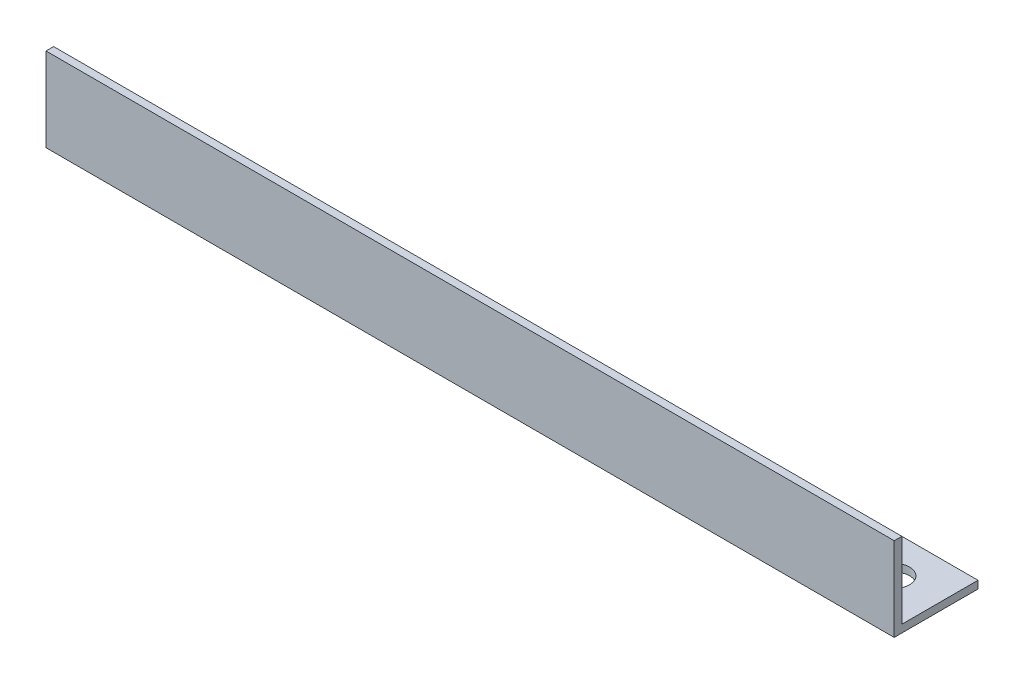
ISO-10303-21;
HEADER;
FILE_DESCRIPTION(('STEP AP214'),'2;1');
FILE_NAME('part.step','',(''),(''),'','','');
FILE_SCHEMA(('AUTOMOTIVE_DESIGN { 1 0 10303 214 1 1 1 1 }'));
ENDSEC;
DATA;
#1=APPLICATION_CONTEXT('core data for automotive mechanical design processes');
#2=APPLICATION_PROTOCOL_DEFINITION('international standard','automotive_design',2000,#1);
#3=PRODUCT_CONTEXT('',#1,'mechanical');
#4=PRODUCT('Part','Part','',(#3));
#5=PRODUCT_RELATED_PRODUCT_CATEGORY('part','',(#4));
#6=PRODUCT_DEFINITION_FORMATION('','',#4);
#7=PRODUCT_DEFINITION_CONTEXT('part definition',#1,'design');
#8=PRODUCT_DEFINITION('design','',#6,#7);
#9=PRODUCT_DEFINITION_SHAPE('','',#8);
#10=(LENGTH_UNIT() NAMED_UNIT(*) SI_UNIT(.MILLI.,.METRE.));
#11=(NAMED_UNIT(*) PLANE_ANGLE_UNIT() SI_UNIT($,.RADIAN.));
#12=(NAMED_UNIT(*) SI_UNIT($,.STERADIAN.) SOLID_ANGLE_UNIT());
#13=UNCERTAINTY_MEASURE_WITH_UNIT(LENGTH_MEASURE(1.E-05),#10,'distance_accuracy_value','');
#14=(GEOMETRIC_REPRESENTATION_CONTEXT(3) GLOBAL_UNCERTAINTY_ASSIGNED_CONTEXT((#13)) GLOBAL_UNIT_ASSIGNED_CONTEXT((#10,
#11,#12)) REPRESENTATION_CONTEXT('',''));
#15=CARTESIAN_POINT('',(0.,0.,0.));
#16=DIRECTION('',(0.,0.,1.));
#17=DIRECTION('',(1.,0.,0.));
#18=AXIS2_PLACEMENT_3D('',#15,#16,#17);
#19=CARTESIAN_POINT('',(334.,0.,0.));
#20=DIRECTION('',(0.,1.,0.));
#21=DIRECTION('',(0.,0.,1.));
#22=AXIS2_PLACEMENT_3D('',#19,#20,#21);
#23=PLANE('',#22);
#24=CARTESIAN_POINT('',(18.0000000000001,0.,-18.));
#25=DIRECTION('',(0.,-1.,0.));
#26=DIRECTION('',(0.,0.,1.));
#27=AXIS2_PLACEMENT_3D('',#24,#25,#26);
#28=CIRCLE('',#27,6.05000000000001);
#29=CARTESIAN_POINT('',(18.0000000000001,0.,-11.95));
#30=VERTEX_POINT('',#29);
#31=EDGE_CURVE('E143',#30,#30,#28,.T.);
#32=ORIENTED_EDGE('',*,*,#31,.F.);
#33=EDGE_LOOP('',(#32));
#34=FACE_BOUND('',#33,.T.);
#35=CARTESIAN_POINT('',(316.,0.,-18.));
#36=DIRECTION('',(0.,-1.,0.));
#37=DIRECTION('',(0.,0.,-1.));
#38=AXIS2_PLACEMENT_3D('',#35,#36,#37);
#39=CIRCLE('',#38,6.05000000000001);
#40=CARTESIAN_POINT('',(316.,0.,-24.05));
#41=VERTEX_POINT('',#40);
#42=EDGE_CURVE('E135',#41,#41,#39,.T.);
#43=ORIENTED_EDGE('',*,*,#42,.F.);
#44=EDGE_LOOP('',(#43));
#45=FACE_BOUND('',#44,.T.);
#46=DIRECTION('',(0.,0.,-1.));
#47=VECTOR('',#46,1.);
#48=CARTESIAN_POINT('',(0.,0.,0.));
#49=LINE('',#48,#47);
#50=CARTESIAN_POINT('',(0.,0.,0.));
#51=VERTEX_POINT('',#50);
#52=CARTESIAN_POINT('',(0.,0.,-33.));
#53=VERTEX_POINT('',#52);
#54=EDGE_CURVE('E117',#51,#53,#49,.T.);
#55=ORIENTED_EDGE('',*,*,#54,.T.);
#56=DIRECTION('',(-1.,0.,0.));
#57=VECTOR('',#56,1.);
#58=CARTESIAN_POINT('',(334.,0.,-33.));
#59=LINE('',#58,#57);
#60=CARTESIAN_POINT('',(334.,0.,-33.));
#61=VERTEX_POINT('',#60);
#62=EDGE_CURVE('E11',#61,#53,#59,.T.);
#63=ORIENTED_EDGE('',*,*,#62,.F.);
#64=DIRECTION('',(0.,0.,-1.));
#65=VECTOR('',#64,1.);
#66=CARTESIAN_POINT('',(334.,0.,0.));
#67=LINE('',#66,#65);
#68=CARTESIAN_POINT('',(334.,0.,0.));
#69=VERTEX_POINT('',#68);
#70=EDGE_CURVE('E82',#69,#61,#67,.T.);
#71=ORIENTED_EDGE('',*,*,#70,.F.);
#72=DIRECTION('',(-1.,0.,0.));
#73=VECTOR('',#72,1.);
#74=CARTESIAN_POINT('',(334.,0.,0.));
#75=LINE('',#74,#73);
#76=EDGE_CURVE('E113',#69,#51,#75,.T.);
#77=ORIENTED_EDGE('',*,*,#76,.T.);
#78=EDGE_LOOP('',(#55,#63,#71,#77));
#79=FACE_BOUND('',#78,.T.);
#80=ADVANCED_FACE('F34',(#34,#45,#79),#23,.F.);
#81=CARTESIAN_POINT('',(334.,3.,-33.));
#82=DIRECTION('',(0.,0.,-1.));
#83=DIRECTION('',(-1.,0.,0.));
#84=AXIS2_PLACEMENT_3D('',#81,#82,#83);
#85=PLANE('',#84);
#86=DIRECTION('',(0.,-1.,0.));
#87=VECTOR('',#86,1.);
#88=CARTESIAN_POINT('',(0.,3.,-33.));
#89=LINE('',#88,#87);
#90=CARTESIAN_POINT('',(0.,3.,-33.));
#91=VERTEX_POINT('',#90);
#92=EDGE_CURVE('E120',#91,#53,#89,.T.);
#93=ORIENTED_EDGE('',*,*,#92,.F.);
#94=DIRECTION('',(-1.,0.,0.));
#95=VECTOR('',#94,1.);
#96=CARTESIAN_POINT('',(334.,3.,-33.));
#97=LINE('',#96,#95);
#98=CARTESIAN_POINT('',(334.,3.,-33.));
#99=VERTEX_POINT('',#98);
#100=EDGE_CURVE('E43',#99,#91,#97,.T.);
#101=ORIENTED_EDGE('',*,*,#100,.F.);
#102=DIRECTION('',(0.,-1.,0.));
#103=VECTOR('',#102,1.);
#104=CARTESIAN_POINT('',(334.,3.,-33.));
#105=LINE('',#104,#103);
#106=EDGE_CURVE('E147',#99,#61,#105,.T.);
#107=ORIENTED_EDGE('',*,*,#106,.T.);
#108=ORIENTED_EDGE('',*,*,#62,.T.);
#109=EDGE_LOOP('',(#93,#101,#107,#108));
#110=FACE_BOUND('',#109,.T.);
#111=ADVANCED_FACE('F168',(#110),#85,.T.);
#112=CARTESIAN_POINT('',(334.,3.,0.));
#113=DIRECTION('',(0.,1.,0.));
#114=DIRECTION('',(0.,0.,1.));
#115=AXIS2_PLACEMENT_3D('',#112,#113,#114);
#116=PLANE('',#115);
#117=CARTESIAN_POINT('',(18.0000000000001,3.,-18.));
#118=DIRECTION('',(0.,1.,0.));
#119=DIRECTION('',(0.,0.,1.));
#120=AXIS2_PLACEMENT_3D('',#117,#118,#119);
#121=CIRCLE('',#120,6.05000000000001);
#122=CARTESIAN_POINT('',(18.0000000000001,3.,-11.95));
#123=VERTEX_POINT('',#122);
#124=EDGE_CURVE('E37',#123,#123,#121,.T.);
#125=ORIENTED_EDGE('',*,*,#124,.F.);
#126=EDGE_LOOP('',(#125));
#127=FACE_BOUND('',#126,.T.);
#128=CARTESIAN_POINT('',(316.,3.,-18.));
#129=DIRECTION('',(0.,1.,0.));
#130=DIRECTION('',(0.,0.,1.));
#131=AXIS2_PLACEMENT_3D('',#128,#129,#130);
#132=CIRCLE('',#131,6.05000000000001);
#133=CARTESIAN_POINT('',(316.,3.,-11.95));
#134=VERTEX_POINT('',#133);
#135=EDGE_CURVE('E121',#134,#134,#132,.T.);
#136=ORIENTED_EDGE('',*,*,#135,.F.);
#137=EDGE_LOOP('',(#136));
#138=FACE_BOUND('',#137,.T.);
#139=DIRECTION('',(0.,0.,-1.));
#140=VECTOR('',#139,1.);
#141=CARTESIAN_POINT('',(0.,3.,0.));
#142=LINE('',#141,#140);
#143=CARTESIAN_POINT('',(0.,3.,-3.));
#144=VERTEX_POINT('',#143);
#145=EDGE_CURVE('E124',#144,#91,#142,.T.);
#146=ORIENTED_EDGE('',*,*,#145,.F.);
#147=DIRECTION('',(-1.,0.,0.));
#148=VECTOR('',#147,1.);
#149=CARTESIAN_POINT('',(334.,3.,-3.));
#150=LINE('',#149,#148);
#151=CARTESIAN_POINT('',(334.,3.,-3.));
#152=VERTEX_POINT('',#151);
#153=EDGE_CURVE('E103',#152,#144,#150,.T.);
#154=ORIENTED_EDGE('',*,*,#153,.F.);
#155=DIRECTION('',(0.,0.,-1.));
#156=VECTOR('',#155,1.);
#157=CARTESIAN_POINT('',(334.,3.,0.));
#158=LINE('',#157,#156);
#159=EDGE_CURVE('E109',#152,#99,#158,.T.);
#160=ORIENTED_EDGE('',*,*,#159,.T.);
#161=ORIENTED_EDGE('',*,*,#100,.T.);
#162=EDGE_LOOP('',(#146,#154,#160,#161));
#163=FACE_BOUND('',#162,.T.);
#164=ADVANCED_FACE('F151',(#127,#138,#163),#116,.T.);
#165=CARTESIAN_POINT('',(334.,33.,-3.));
#166=DIRECTION('',(0.,0.,-1.));
#167=DIRECTION('',(0.,1.,0.));
#168=AXIS2_PLACEMENT_3D('',#165,#166,#167);
#169=PLANE('',#168);
#170=DIRECTION('',(0.,-1.,0.));
#171=VECTOR('',#170,1.);
#172=CARTESIAN_POINT('',(0.,33.,-3.));
#173=LINE('',#172,#171);
#174=CARTESIAN_POINT('',(0.,33.,-3.));
#175=VERTEX_POINT('',#174);
#176=EDGE_CURVE('E98',#175,#144,#173,.T.);
#177=ORIENTED_EDGE('',*,*,#176,.F.);
#178=DIRECTION('',(-1.,0.,0.));
#179=VECTOR('',#178,1.);
#180=CARTESIAN_POINT('',(334.,33.,-3.));
#181=LINE('',#180,#179);
#182=CARTESIAN_POINT('',(334.,33.,-3.));
#183=VERTEX_POINT('',#182);
#184=EDGE_CURVE('E93',#183,#175,#181,.T.);
#185=ORIENTED_EDGE('',*,*,#184,.F.);
#186=DIRECTION('',(0.,-1.,0.));
#187=VECTOR('',#186,1.);
#188=CARTESIAN_POINT('',(334.,33.,-3.));
#189=LINE('',#188,#187);
#190=EDGE_CURVE('E96',#183,#152,#189,.T.);
#191=ORIENTED_EDGE('',*,*,#190,.T.);
#192=ORIENTED_EDGE('',*,*,#153,.T.);
#193=EDGE_LOOP('',(#177,#185,#191,#192));
#194=FACE_BOUND('',#193,.T.);
#195=ADVANCED_FACE('F95',(#194),#169,.T.);
#196=CARTESIAN_POINT('',(334.,33.,0.));
#197=DIRECTION('',(0.,1.,0.));
#198=DIRECTION('',(0.,0.,1.));
#199=AXIS2_PLACEMENT_3D('',#196,#197,#198);
#200=PLANE('',#199);
#201=DIRECTION('',(0.,0.,-1.));
#202=VECTOR('',#201,1.);
#203=CARTESIAN_POINT('',(0.,33.,0.));
#204=LINE('',#203,#202);
#205=CARTESIAN_POINT('',(0.,33.,0.));
#206=VERTEX_POINT('',#205);
#207=EDGE_CURVE('E128',#206,#175,#204,.T.);
#208=ORIENTED_EDGE('',*,*,#207,.F.);
#209=DIRECTION('',(-1.,0.,0.));
#210=VECTOR('',#209,1.);
#211=CARTESIAN_POINT('',(334.,33.,0.));
#212=LINE('',#211,#210);
#213=CARTESIAN_POINT('',(334.,33.,0.));
#214=VERTEX_POINT('',#213);
#215=EDGE_CURVE('E73',#214,#206,#212,.T.);
#216=ORIENTED_EDGE('',*,*,#215,.F.);
#217=DIRECTION('',(0.,0.,-1.));
#218=VECTOR('',#217,1.);
#219=CARTESIAN_POINT('',(334.,33.,0.));
#220=LINE('',#219,#218);
#221=EDGE_CURVE('E107',#214,#183,#220,.T.);
#222=ORIENTED_EDGE('',*,*,#221,.T.);
#223=ORIENTED_EDGE('',*,*,#184,.T.);
#224=EDGE_LOOP('',(#208,#216,#222,#223));
#225=FACE_BOUND('',#224,.T.);
#226=ADVANCED_FACE('F111',(#225),#200,.T.);
#227=CARTESIAN_POINT('',(334.,33.,0.));
#228=DIRECTION('',(0.,0.,-1.));
#229=DIRECTION('',(0.,1.,0.));
#230=AXIS2_PLACEMENT_3D('',#227,#228,#229);
#231=PLANE('',#230);
#232=DIRECTION('',(0.,-1.,0.));
#233=VECTOR('',#232,1.);
#234=CARTESIAN_POINT('',(0.,33.,0.));
#235=LINE('',#234,#233);
#236=EDGE_CURVE('E76',#206,#51,#235,.T.);
#237=ORIENTED_EDGE('',*,*,#236,.T.);
#238=ORIENTED_EDGE('',*,*,#76,.F.);
#239=DIRECTION('',(0.,-1.,0.));
#240=VECTOR('',#239,1.);
#241=CARTESIAN_POINT('',(334.,33.,0.));
#242=LINE('',#241,#240);
#243=EDGE_CURVE('E52',#214,#69,#242,.T.);
#244=ORIENTED_EDGE('',*,*,#243,.F.);
#245=ORIENTED_EDGE('',*,*,#215,.T.);
#246=EDGE_LOOP('',(#237,#238,#244,#245));
#247=FACE_BOUND('',#246,.T.);
#248=ADVANCED_FACE('F157',(#247),#231,.F.);
#249=CARTESIAN_POINT('',(334.,0.,0.));
#250=DIRECTION('',(-1.,0.,0.));
#251=DIRECTION('',(0.,0.,1.));
#252=AXIS2_PLACEMENT_3D('',#249,#250,#251);
#253=PLANE('',#252);
#254=ORIENTED_EDGE('',*,*,#70,.T.);
#255=ORIENTED_EDGE('',*,*,#106,.F.);
#256=ORIENTED_EDGE('',*,*,#159,.F.);
#257=ORIENTED_EDGE('',*,*,#190,.F.);
#258=ORIENTED_EDGE('',*,*,#221,.F.);
#259=ORIENTED_EDGE('',*,*,#243,.T.);
#260=EDGE_LOOP('',(#254,#255,#256,#257,#258,#259));
#261=FACE_BOUND('',#260,.T.);
#262=ADVANCED_FACE('F106',(#261),#253,.F.);
#263=CARTESIAN_POINT('',(0.,0.,0.));
#264=DIRECTION('',(-1.,0.,0.));
#265=DIRECTION('',(0.,0.,1.));
#266=AXIS2_PLACEMENT_3D('',#263,#264,#265);
#267=PLANE('',#266);
#268=ORIENTED_EDGE('',*,*,#54,.F.);
#269=ORIENTED_EDGE('',*,*,#236,.F.);
#270=ORIENTED_EDGE('',*,*,#207,.T.);
#271=ORIENTED_EDGE('',*,*,#176,.T.);
#272=ORIENTED_EDGE('',*,*,#145,.T.);
#273=ORIENTED_EDGE('',*,*,#92,.T.);
#274=EDGE_LOOP('',(#268,#269,#270,#271,#272,#273));
#275=FACE_BOUND('',#274,.T.);
#276=ADVANCED_FACE('F155',(#275),#267,.T.);
#277=CARTESIAN_POINT('',(316.,33.,-18.));
#278=DIRECTION('',(0.,-1.,0.));
#279=DIRECTION('',(0.,0.,-1.));
#280=AXIS2_PLACEMENT_3D('',#277,#278,#279);
#281=CYLINDRICAL_SURFACE('',#280,6.05000000000001);
#282=ORIENTED_EDGE('',*,*,#135,.T.);
#283=EDGE_LOOP('',(#282));
#284=FACE_BOUND('',#283,.T.);
#285=ORIENTED_EDGE('',*,*,#42,.T.);
#286=EDGE_LOOP('',(#285));
#287=FACE_BOUND('',#286,.T.);
#288=ADVANCED_FACE('F180',(#284,#287),#281,.F.);
#289=CARTESIAN_POINT('',(18.0000000000001,33.,-18.));
#290=DIRECTION('',(0.,-1.,0.));
#291=DIRECTION('',(0.,0.,-1.));
#292=AXIS2_PLACEMENT_3D('',#289,#290,#291);
#293=CYLINDRICAL_SURFACE('',#292,6.05000000000001);
#294=ORIENTED_EDGE('',*,*,#124,.T.);
#295=EDGE_LOOP('',(#294));
#296=FACE_BOUND('',#295,.T.);
#297=ORIENTED_EDGE('',*,*,#31,.T.);
#298=EDGE_LOOP('',(#297));
#299=FACE_BOUND('',#298,.T.);
#300=ADVANCED_FACE('F178',(#296,#299),#293,.F.);
#301=CLOSED_SHELL('',(#80,#111,#164,#195,#226,#248,#262,#276,#288,#300));
#302=MANIFOLD_SOLID_BREP('B2',#301);
#303=ADVANCED_BREP_SHAPE_REPRESENTATION('',(#18,#302),#14);
#304=SHAPE_DEFINITION_REPRESENTATION(#9,#303);
ENDSEC;
END-ISO-10303-21;
